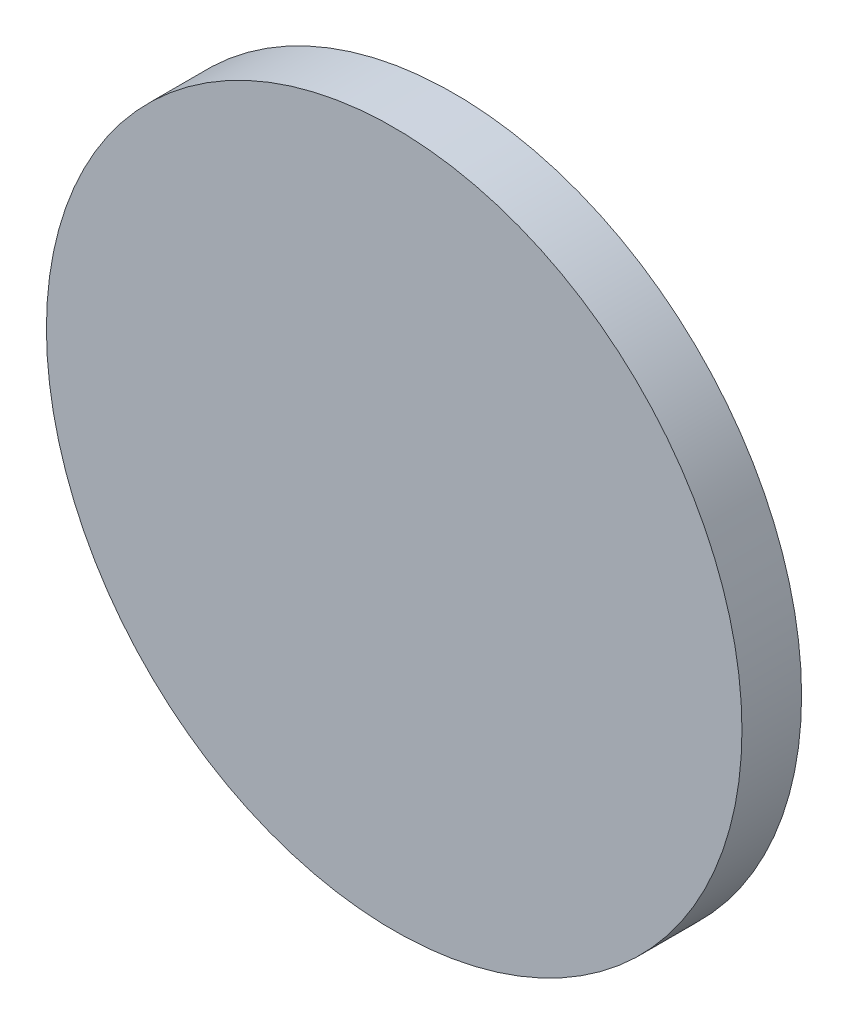
ISO-10303-21;
HEADER;
FILE_DESCRIPTION(('STEP AP214'),'2;1');
FILE_NAME('part.step','',(''),(''),'','','');
FILE_SCHEMA(('AUTOMOTIVE_DESIGN { 1 0 10303 214 1 1 1 1 }'));
ENDSEC;
DATA;
#1=APPLICATION_CONTEXT('core data for automotive mechanical design processes');
#2=APPLICATION_PROTOCOL_DEFINITION('international standard','automotive_design',2000,#1);
#3=PRODUCT_CONTEXT('',#1,'mechanical');
#4=PRODUCT('Part','Part','',(#3));
#5=PRODUCT_RELATED_PRODUCT_CATEGORY('part','',(#4));
#6=PRODUCT_DEFINITION_FORMATION('','',#4);
#7=PRODUCT_DEFINITION_CONTEXT('part definition',#1,'design');
#8=PRODUCT_DEFINITION('design','',#6,#7);
#9=PRODUCT_DEFINITION_SHAPE('','',#8);
#10=(LENGTH_UNIT() NAMED_UNIT(*) SI_UNIT(.MILLI.,.METRE.));
#11=(NAMED_UNIT(*) PLANE_ANGLE_UNIT() SI_UNIT($,.RADIAN.));
#12=(NAMED_UNIT(*) SI_UNIT($,.STERADIAN.) SOLID_ANGLE_UNIT());
#13=UNCERTAINTY_MEASURE_WITH_UNIT(LENGTH_MEASURE(1.E-05),#10,'distance_accuracy_value','');
#14=(GEOMETRIC_REPRESENTATION_CONTEXT(3) GLOBAL_UNCERTAINTY_ASSIGNED_CONTEXT((#13)) GLOBAL_UNIT_ASSIGNED_CONTEXT((#10,
#11,#12)) REPRESENTATION_CONTEXT('',''));
#15=CARTESIAN_POINT('',(0.,0.,0.));
#16=DIRECTION('',(0.,0.,1.));
#17=DIRECTION('',(1.,0.,0.));
#18=AXIS2_PLACEMENT_3D('',#15,#16,#17);
#19=CARTESIAN_POINT('',(11.539,2.991000014875,0.));
#20=DIRECTION('',(0.,0.,-1.));
#21=DIRECTION('',(-1.,0.,0.));
#22=AXIS2_PLACEMENT_3D('',#19,#20,#21);
#23=PLANE('',#22);
#24=CARTESIAN_POINT('',(11.539,2.991000014875,0.));
#25=DIRECTION('',(0.,0.,1.));
#26=DIRECTION('',(1.,0.,0.));
#27=AXIS2_PLACEMENT_3D('',#24,#25,#26);
#28=CIRCLE('',#27,0.200024667);
#29=CARTESIAN_POINT('',(11.739024667,2.991000014875,0.));
#30=VERTEX_POINT('',#29);
#31=EDGE_CURVE('E18',#30,#30,#28,.T.);
#32=ORIENTED_EDGE('',*,*,#31,.F.);
#33=EDGE_LOOP('',(#32));
#34=FACE_BOUND('',#33,.T.);
#35=ADVANCED_FACE('F15',(#34),#23,.T.);
#36=CARTESIAN_POINT('',(11.539,2.991000014875,0.));
#37=DIRECTION('',(0.,0.,1.));
#38=DIRECTION('',(1.,0.,0.));
#39=AXIS2_PLACEMENT_3D('',#36,#37,#38);
#40=CYLINDRICAL_SURFACE('',#39,0.200024667);
#41=CARTESIAN_POINT('',(11.539,2.991000014875,0.03429));
#42=DIRECTION('',(0.,0.,1.));
#43=DIRECTION('',(1.,0.,0.));
#44=AXIS2_PLACEMENT_3D('',#41,#42,#43);
#45=CIRCLE('',#44,0.200024667);
#46=CARTESIAN_POINT('',(11.739024667,2.991000014875,0.03429));
#47=VERTEX_POINT('',#46);
#48=EDGE_CURVE('E10',#47,#47,#45,.T.);
#49=ORIENTED_EDGE('',*,*,#48,.F.);
#50=EDGE_LOOP('',(#49));
#51=FACE_BOUND('',#50,.T.);
#52=ORIENTED_EDGE('',*,*,#31,.T.);
#53=EDGE_LOOP('',(#52));
#54=FACE_BOUND('',#53,.T.);
#55=ADVANCED_FACE('F27',(#51,#54),#40,.T.);
#56=CARTESIAN_POINT('',(11.539,2.991000014875,0.03429));
#57=DIRECTION('',(0.,0.,1.));
#58=DIRECTION('',(1.,0.,0.));
#59=AXIS2_PLACEMENT_3D('',#56,#57,#58);
#60=PLANE('',#59);
#61=ORIENTED_EDGE('',*,*,#48,.T.);
#62=EDGE_LOOP('',(#61));
#63=FACE_BOUND('',#62,.T.);
#64=ADVANCED_FACE('F34',(#63),#60,.T.);
#65=CLOSED_SHELL('',(#35,#55,#64));
#66=MANIFOLD_SOLID_BREP('B1',#65);
#67=ADVANCED_BREP_SHAPE_REPRESENTATION('',(#18,#66),#14);
#68=SHAPE_DEFINITION_REPRESENTATION(#9,#67);
ENDSEC;
END-ISO-10303-21;
